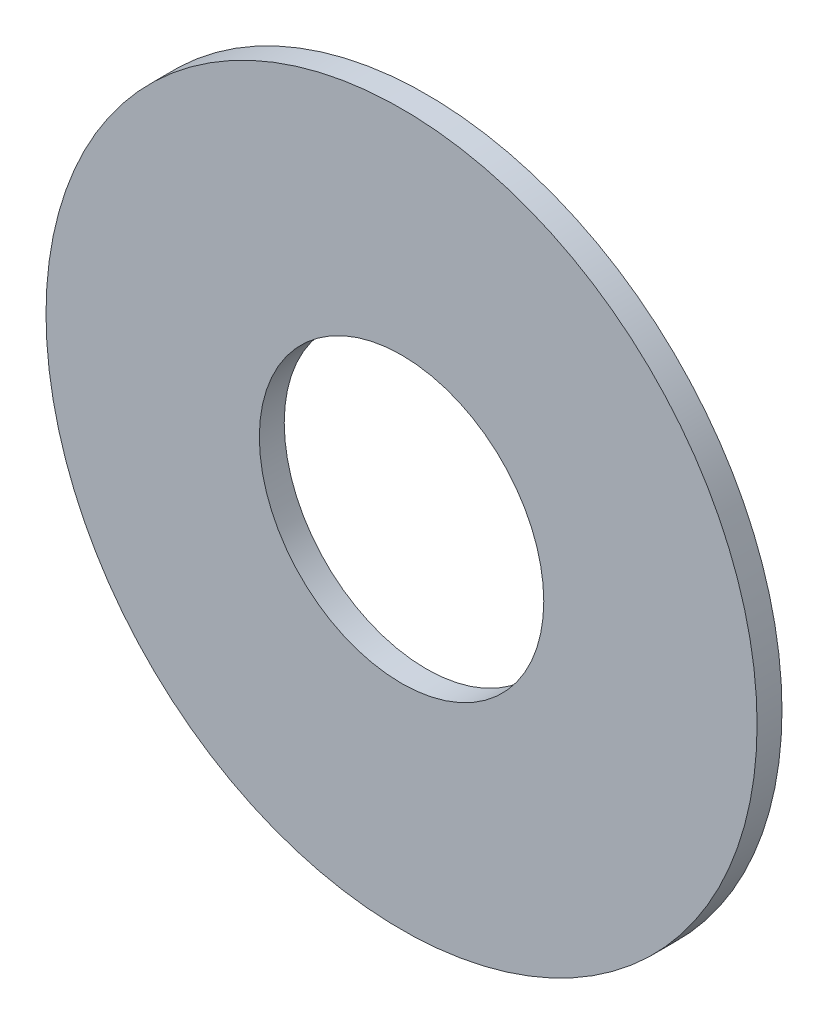
ISO-10303-21;
HEADER;
FILE_DESCRIPTION(('STEP AP214'),'2;1');
FILE_NAME('part.step','',(''),(''),'','','');
FILE_SCHEMA(('AUTOMOTIVE_DESIGN { 1 0 10303 214 1 1 1 1 }'));
ENDSEC;
DATA;
#1=APPLICATION_CONTEXT('core data for automotive mechanical design processes');
#2=APPLICATION_PROTOCOL_DEFINITION('international standard','automotive_design',2000,#1);
#3=PRODUCT_CONTEXT('',#1,'mechanical');
#4=PRODUCT('Part','Part','',(#3));
#5=PRODUCT_RELATED_PRODUCT_CATEGORY('part','',(#4));
#6=PRODUCT_DEFINITION_FORMATION('','',#4);
#7=PRODUCT_DEFINITION_CONTEXT('part definition',#1,'design');
#8=PRODUCT_DEFINITION('design','',#6,#7);
#9=PRODUCT_DEFINITION_SHAPE('','',#8);
#10=(LENGTH_UNIT() NAMED_UNIT(*) SI_UNIT(.MILLI.,.METRE.));
#11=(NAMED_UNIT(*) PLANE_ANGLE_UNIT() SI_UNIT($,.RADIAN.));
#12=(NAMED_UNIT(*) SI_UNIT($,.STERADIAN.) SOLID_ANGLE_UNIT());
#13=UNCERTAINTY_MEASURE_WITH_UNIT(LENGTH_MEASURE(1.E-05),#10,'distance_accuracy_value','');
#14=(GEOMETRIC_REPRESENTATION_CONTEXT(3) GLOBAL_UNCERTAINTY_ASSIGNED_CONTEXT((#13)) GLOBAL_UNIT_ASSIGNED_CONTEXT((#10,
#11,#12)) REPRESENTATION_CONTEXT('',''));
#15=CARTESIAN_POINT('',(0.,0.,0.));
#16=DIRECTION('',(0.,0.,1.));
#17=DIRECTION('',(1.,0.,0.));
#18=AXIS2_PLACEMENT_3D('',#15,#16,#17);
#19=CARTESIAN_POINT('',(0.,0.,0.7));
#20=DIRECTION('',(0.,0.,-1.));
#21=DIRECTION('',(-1.,0.,0.));
#22=AXIS2_PLACEMENT_3D('',#19,#20,#21);
#23=CYLINDRICAL_SURFACE('',#22,10.);
#24=CARTESIAN_POINT('',(0.,0.,0.7));
#25=DIRECTION('',(0.,0.,1.));
#26=DIRECTION('',(1.,0.,0.));
#27=AXIS2_PLACEMENT_3D('',#24,#25,#26);
#28=CIRCLE('',#27,10.);
#29=CARTESIAN_POINT('',(10.,0.,0.7));
#30=VERTEX_POINT('',#29);
#31=EDGE_CURVE('E10',#30,#30,#28,.T.);
#32=ORIENTED_EDGE('',*,*,#31,.F.);
#33=EDGE_LOOP('',(#32));
#34=FACE_BOUND('',#33,.T.);
#35=CARTESIAN_POINT('',(0.,0.,0.));
#36=DIRECTION('',(0.,0.,1.));
#37=DIRECTION('',(1.,0.,0.));
#38=AXIS2_PLACEMENT_3D('',#35,#36,#37);
#39=CIRCLE('',#38,10.);
#40=CARTESIAN_POINT('',(10.,0.,0.));
#41=VERTEX_POINT('',#40);
#42=EDGE_CURVE('E43',#41,#41,#39,.T.);
#43=ORIENTED_EDGE('',*,*,#42,.T.);
#44=EDGE_LOOP('',(#43));
#45=FACE_BOUND('',#44,.T.);
#46=ADVANCED_FACE('F36',(#34,#45),#23,.T.);
#47=CARTESIAN_POINT('',(0.,0.,0.7));
#48=DIRECTION('',(0.,0.,1.));
#49=DIRECTION('',(1.,0.,0.));
#50=AXIS2_PLACEMENT_3D('',#47,#48,#49);
#51=PLANE('',#50);
#52=CARTESIAN_POINT('',(0.,0.,0.7));
#53=DIRECTION('',(0.,0.,1.));
#54=DIRECTION('',(1.,0.,0.));
#55=AXIS2_PLACEMENT_3D('',#52,#53,#54);
#56=CIRCLE('',#55,4.);
#57=CARTESIAN_POINT('',(4.,0.,0.7));
#58=VERTEX_POINT('',#57);
#59=EDGE_CURVE('E49',#58,#58,#56,.T.);
#60=ORIENTED_EDGE('',*,*,#59,.F.);
#61=EDGE_LOOP('',(#60));
#62=FACE_BOUND('',#61,.T.);
#63=ORIENTED_EDGE('',*,*,#31,.T.);
#64=EDGE_LOOP('',(#63));
#65=FACE_BOUND('',#64,.T.);
#66=ADVANCED_FACE('F65',(#62,#65),#51,.T.);
#67=CARTESIAN_POINT('',(0.,0.,0.));
#68=DIRECTION('',(0.,0.,1.));
#69=DIRECTION('',(1.,0.,0.));
#70=AXIS2_PLACEMENT_3D('',#67,#68,#69);
#71=PLANE('',#70);
#72=CARTESIAN_POINT('',(0.,0.,0.));
#73=DIRECTION('',(0.,0.,1.));
#74=DIRECTION('',(1.,0.,0.));
#75=AXIS2_PLACEMENT_3D('',#72,#73,#74);
#76=CIRCLE('',#75,4.);
#77=CARTESIAN_POINT('',(4.,0.,0.));
#78=VERTEX_POINT('',#77);
#79=EDGE_CURVE('E39',#78,#78,#76,.T.);
#80=ORIENTED_EDGE('',*,*,#79,.T.);
#81=EDGE_LOOP('',(#80));
#82=FACE_BOUND('',#81,.T.);
#83=ORIENTED_EDGE('',*,*,#42,.F.);
#84=EDGE_LOOP('',(#83));
#85=FACE_BOUND('',#84,.T.);
#86=ADVANCED_FACE('F56',(#82,#85),#71,.F.);
#87=CARTESIAN_POINT('',(0.,0.,-0.8));
#88=DIRECTION('',(0.,0.,1.));
#89=DIRECTION('',(1.,0.,0.));
#90=AXIS2_PLACEMENT_3D('',#87,#88,#89);
#91=CYLINDRICAL_SURFACE('',#90,4.);
#92=ORIENTED_EDGE('',*,*,#59,.T.);
#93=EDGE_LOOP('',(#92));
#94=FACE_BOUND('',#93,.T.);
#95=ORIENTED_EDGE('',*,*,#79,.F.);
#96=EDGE_LOOP('',(#95));
#97=FACE_BOUND('',#96,.T.);
#98=ADVANCED_FACE('F59',(#94,#97),#91,.F.);
#99=CLOSED_SHELL('',(#46,#66,#86,#98));
#100=MANIFOLD_SOLID_BREP('B2',#99);
#101=ADVANCED_BREP_SHAPE_REPRESENTATION('',(#18,#100),#14);
#102=SHAPE_DEFINITION_REPRESENTATION(#9,#101);
ENDSEC;
END-ISO-10303-21;
